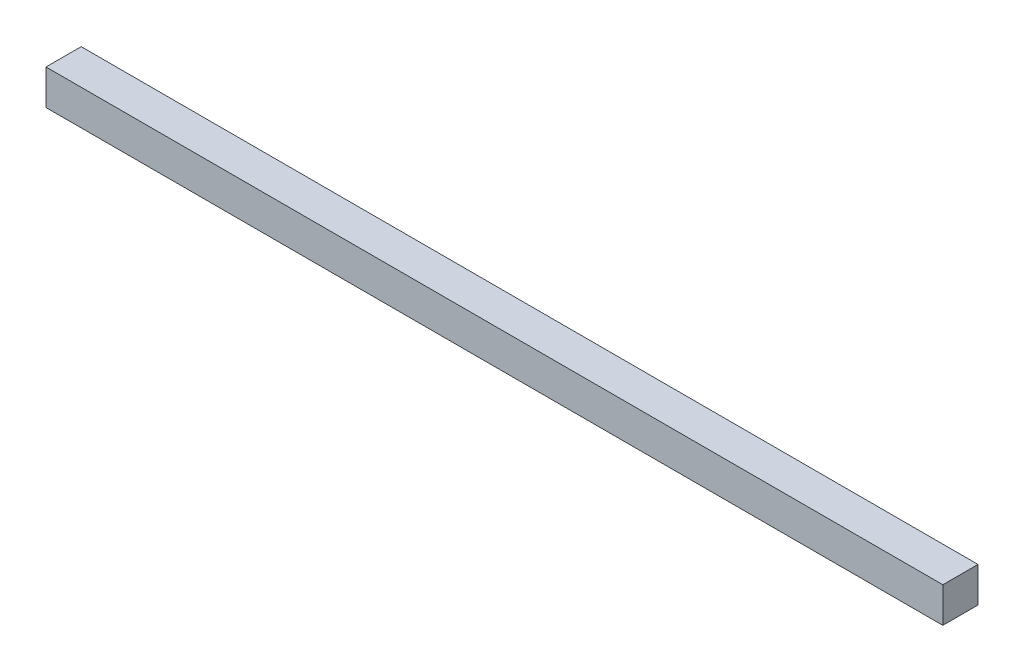
ISO-10303-21;
HEADER;
FILE_DESCRIPTION(('STEP AP214'),'2;1');
FILE_NAME('part.step','',(''),(''),'','','');
FILE_SCHEMA(('AUTOMOTIVE_DESIGN { 1 0 10303 214 1 1 1 1 }'));
ENDSEC;
DATA;
#1=APPLICATION_CONTEXT('core data for automotive mechanical design processes');
#2=APPLICATION_PROTOCOL_DEFINITION('international standard','automotive_design',2000,#1);
#3=PRODUCT_CONTEXT('',#1,'mechanical');
#4=PRODUCT('Part','Part','',(#3));
#5=PRODUCT_RELATED_PRODUCT_CATEGORY('part','',(#4));
#6=PRODUCT_DEFINITION_FORMATION('','',#4);
#7=PRODUCT_DEFINITION_CONTEXT('part definition',#1,'design');
#8=PRODUCT_DEFINITION('design','',#6,#7);
#9=PRODUCT_DEFINITION_SHAPE('','',#8);
#10=(LENGTH_UNIT() NAMED_UNIT(*) SI_UNIT(.MILLI.,.METRE.));
#11=(NAMED_UNIT(*) PLANE_ANGLE_UNIT() SI_UNIT($,.RADIAN.));
#12=(NAMED_UNIT(*) SI_UNIT($,.STERADIAN.) SOLID_ANGLE_UNIT());
#13=UNCERTAINTY_MEASURE_WITH_UNIT(LENGTH_MEASURE(1.E-05),#10,'distance_accuracy_value','');
#14=(GEOMETRIC_REPRESENTATION_CONTEXT(3) GLOBAL_UNCERTAINTY_ASSIGNED_CONTEXT((#13)) GLOBAL_UNIT_ASSIGNED_CONTEXT((#10,
#11,#12)) REPRESENTATION_CONTEXT('',''));
#15=CARTESIAN_POINT('',(0.,0.,0.));
#16=DIRECTION('',(0.,0.,1.));
#17=DIRECTION('',(1.,0.,0.));
#18=AXIS2_PLACEMENT_3D('',#15,#16,#17);
#19=CARTESIAN_POINT('',(521.515,-20.0000000000001,0.));
#20=DIRECTION('',(0.,1.,0.));
#21=DIRECTION('',(0.,0.,1.));
#22=AXIS2_PLACEMENT_3D('',#19,#20,#21);
#23=PLANE('',#22);
#24=DIRECTION('',(0.,0.,-1.));
#25=VECTOR('',#24,1.);
#26=CARTESIAN_POINT('',(1020.03,-20.0000000000001,20.));
#27=LINE('',#26,#25);
#28=CARTESIAN_POINT('',(1020.03,-20.0000000000001,20.));
#29=VERTEX_POINT('',#28);
#30=CARTESIAN_POINT('',(1020.03,-20.0000000000001,-20.));
#31=VERTEX_POINT('',#30);
#32=EDGE_CURVE('E79',#29,#31,#27,.T.);
#33=ORIENTED_EDGE('',*,*,#32,.F.);
#34=DIRECTION('',(1.,0.,0.));
#35=VECTOR('',#34,1.);
#36=CARTESIAN_POINT('',(521.515,-20.,20.));
#37=LINE('',#36,#35);
#38=CARTESIAN_POINT('',(0.,-20.,20.));
#39=VERTEX_POINT('',#38);
#40=EDGE_CURVE('E37',#39,#29,#37,.T.);
#41=ORIENTED_EDGE('',*,*,#40,.F.);
#42=DIRECTION('',(0.,0.,1.));
#43=VECTOR('',#42,1.);
#44=CARTESIAN_POINT('',(0.,-20.,0.));
#45=LINE('',#44,#43);
#46=CARTESIAN_POINT('',(0.,-20.,-20.));
#47=VERTEX_POINT('',#46);
#48=EDGE_CURVE('E93',#39,#47,#45,.F.);
#49=ORIENTED_EDGE('',*,*,#48,.T.);
#50=DIRECTION('',(1.,0.,0.));
#51=VECTOR('',#50,1.);
#52=CARTESIAN_POINT('',(521.515,-20.,-20.));
#53=LINE('',#52,#51);
#54=EDGE_CURVE('E87',#47,#31,#53,.T.);
#55=ORIENTED_EDGE('',*,*,#54,.T.);
#56=EDGE_LOOP('',(#33,#41,#49,#55));
#57=FACE_BOUND('',#56,.T.);
#58=ADVANCED_FACE('F34',(#57),#23,.F.);
#59=CARTESIAN_POINT('',(521.515,0.,20.));
#60=DIRECTION('',(0.,0.,1.));
#61=DIRECTION('',(1.,0.,0.));
#62=AXIS2_PLACEMENT_3D('',#59,#60,#61);
#63=PLANE('',#62);
#64=ORIENTED_EDGE('',*,*,#40,.T.);
#65=DIRECTION('',(0.,-1.,0.));
#66=VECTOR('',#65,1.);
#67=CARTESIAN_POINT('',(1020.03,19.9999999999998,20.));
#68=LINE('',#67,#66);
#69=CARTESIAN_POINT('',(1020.03,19.9999999999998,20.));
#70=VERTEX_POINT('',#69);
#71=EDGE_CURVE('E81',#70,#29,#68,.T.);
#72=ORIENTED_EDGE('',*,*,#71,.F.);
#73=DIRECTION('',(1.,0.,0.));
#74=VECTOR('',#73,1.);
#75=CARTESIAN_POINT('',(521.515,19.9999999999999,20.));
#76=LINE('',#75,#74);
#77=CARTESIAN_POINT('',(0.,19.9999999999999,20.));
#78=VERTEX_POINT('',#77);
#79=EDGE_CURVE('E99',#70,#78,#76,.F.);
#80=ORIENTED_EDGE('',*,*,#79,.T.);
#81=DIRECTION('',(0.,1.,0.));
#82=VECTOR('',#81,1.);
#83=CARTESIAN_POINT('',(0.,0.,20.));
#84=LINE('',#83,#82);
#85=EDGE_CURVE('E92',#78,#39,#84,.F.);
#86=ORIENTED_EDGE('',*,*,#85,.T.);
#87=EDGE_LOOP('',(#64,#72,#80,#86));
#88=FACE_BOUND('',#87,.T.);
#89=ADVANCED_FACE('F90',(#88),#63,.T.);
#90=CARTESIAN_POINT('',(521.515,0.,-20.));
#91=DIRECTION('',(0.,0.,1.));
#92=DIRECTION('',(1.,0.,0.));
#93=AXIS2_PLACEMENT_3D('',#90,#91,#92);
#94=PLANE('',#93);
#95=DIRECTION('',(0.,1.,0.));
#96=VECTOR('',#95,1.);
#97=CARTESIAN_POINT('',(1020.03,19.9999999999998,-20.));
#98=LINE('',#97,#96);
#99=CARTESIAN_POINT('',(1020.03,19.9999999999998,-20.));
#100=VERTEX_POINT('',#99);
#101=EDGE_CURVE('E50',#31,#100,#98,.T.);
#102=ORIENTED_EDGE('',*,*,#101,.F.);
#103=ORIENTED_EDGE('',*,*,#54,.F.);
#104=DIRECTION('',(0.,1.,0.));
#105=VECTOR('',#104,1.);
#106=CARTESIAN_POINT('',(0.,0.,-20.));
#107=LINE('',#106,#105);
#108=CARTESIAN_POINT('',(0.,20.,-20.));
#109=VERTEX_POINT('',#108);
#110=EDGE_CURVE('E58',#109,#47,#107,.F.);
#111=ORIENTED_EDGE('',*,*,#110,.F.);
#112=DIRECTION('',(1.,0.,0.));
#113=VECTOR('',#112,1.);
#114=CARTESIAN_POINT('',(521.515,19.9999999999999,-20.));
#115=LINE('',#114,#113);
#116=EDGE_CURVE('E11',#109,#100,#115,.T.);
#117=ORIENTED_EDGE('',*,*,#116,.T.);
#118=EDGE_LOOP('',(#102,#103,#111,#117));
#119=FACE_BOUND('',#118,.T.);
#120=ADVANCED_FACE('F104',(#119),#94,.F.);
#121=CARTESIAN_POINT('',(521.515,19.9999999999999,0.));
#122=DIRECTION('',(0.,-1.,0.));
#123=DIRECTION('',(1.,0.,0.));
#124=AXIS2_PLACEMENT_3D('',#121,#122,#123);
#125=PLANE('',#124);
#126=DIRECTION('',(0.,0.,1.));
#127=VECTOR('',#126,1.);
#128=CARTESIAN_POINT('',(1020.03,19.9999999999998,20.));
#129=LINE('',#128,#127);
#130=EDGE_CURVE('E76',#100,#70,#129,.T.);
#131=ORIENTED_EDGE('',*,*,#130,.F.);
#132=ORIENTED_EDGE('',*,*,#116,.F.);
#133=DIRECTION('',(0.,0.,1.));
#134=VECTOR('',#133,1.);
#135=CARTESIAN_POINT('',(0.,20.,0.));
#136=LINE('',#135,#134);
#137=EDGE_CURVE('E42',#78,#109,#136,.F.);
#138=ORIENTED_EDGE('',*,*,#137,.F.);
#139=ORIENTED_EDGE('',*,*,#79,.F.);
#140=EDGE_LOOP('',(#131,#132,#138,#139));
#141=FACE_BOUND('',#140,.T.);
#142=ADVANCED_FACE('F108',(#141),#125,.F.);
#143=CARTESIAN_POINT('',(0.,0.,0.));
#144=DIRECTION('',(1.,0.,0.));
#145=DIRECTION('',(0.,1.,0.));
#146=AXIS2_PLACEMENT_3D('',#143,#144,#145);
#147=PLANE('',#146);
#148=ORIENTED_EDGE('',*,*,#110,.T.);
#149=ORIENTED_EDGE('',*,*,#48,.F.);
#150=ORIENTED_EDGE('',*,*,#85,.F.);
#151=ORIENTED_EDGE('',*,*,#137,.T.);
#152=EDGE_LOOP('',(#148,#149,#150,#151));
#153=FACE_BOUND('',#152,.T.);
#154=ADVANCED_FACE('F105',(#153),#147,.F.);
#155=CARTESIAN_POINT('',(1020.03,0.,0.));
#156=DIRECTION('',(1.,0.,0.));
#157=DIRECTION('',(0.,0.,-1.));
#158=AXIS2_PLACEMENT_3D('',#155,#156,#157);
#159=PLANE('',#158);
#160=ORIENTED_EDGE('',*,*,#71,.T.);
#161=ORIENTED_EDGE('',*,*,#32,.T.);
#162=ORIENTED_EDGE('',*,*,#101,.T.);
#163=ORIENTED_EDGE('',*,*,#130,.T.);
#164=EDGE_LOOP('',(#160,#161,#162,#163));
#165=FACE_BOUND('',#164,.T.);
#166=ADVANCED_FACE('F82',(#165),#159,.T.);
#167=CLOSED_SHELL('',(#58,#89,#120,#142,#154,#166));
#168=MANIFOLD_SOLID_BREP('B2',#167);
#169=ADVANCED_BREP_SHAPE_REPRESENTATION('',(#18,#168),#14);
#170=SHAPE_DEFINITION_REPRESENTATION(#9,#169);
ENDSEC;
END-ISO-10303-21;
